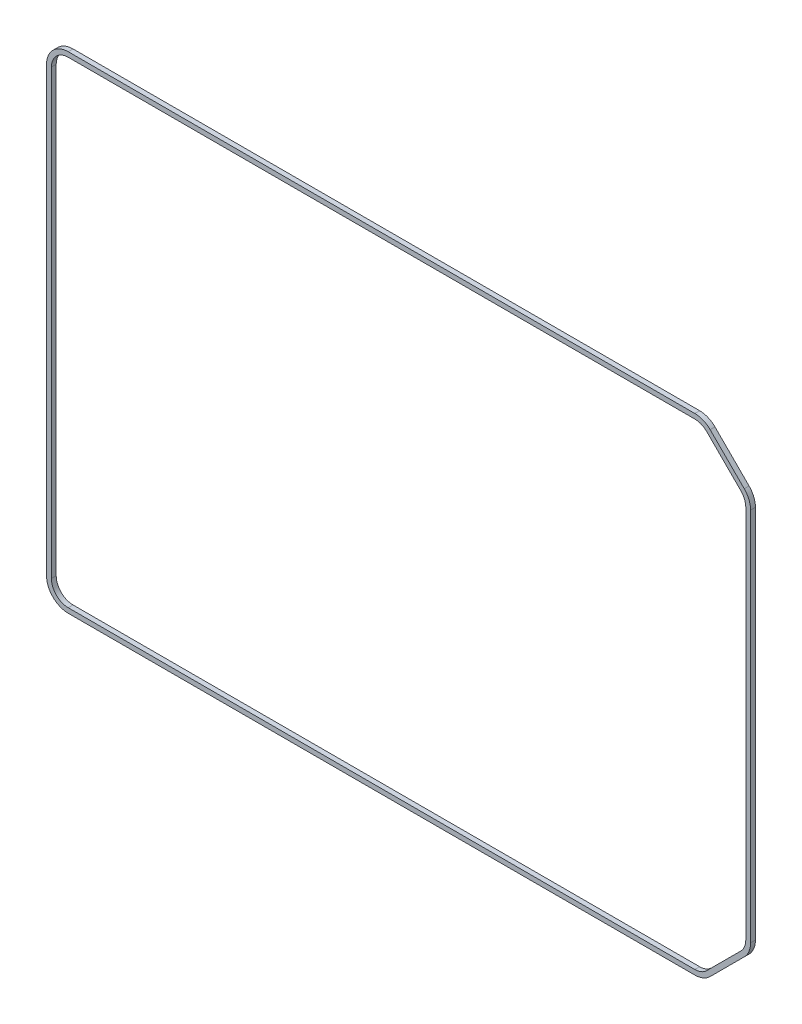
ISO-10303-21;
HEADER;
FILE_DESCRIPTION(('STEP AP214'),'2;1');
FILE_NAME('part.step','',(''),(''),'','','');
FILE_SCHEMA(('AUTOMOTIVE_DESIGN { 1 0 10303 214 1 1 1 1 }'));
ENDSEC;
DATA;
#1=APPLICATION_CONTEXT('core data for automotive mechanical design processes');
#2=APPLICATION_PROTOCOL_DEFINITION('international standard','automotive_design',2000,#1);
#3=PRODUCT_CONTEXT('',#1,'mechanical');
#4=PRODUCT('Part','Part','',(#3));
#5=PRODUCT_RELATED_PRODUCT_CATEGORY('part','',(#4));
#6=PRODUCT_DEFINITION_FORMATION('','',#4);
#7=PRODUCT_DEFINITION_CONTEXT('part definition',#1,'design');
#8=PRODUCT_DEFINITION('design','',#6,#7);
#9=PRODUCT_DEFINITION_SHAPE('','',#8);
#10=(LENGTH_UNIT() NAMED_UNIT(*) SI_UNIT(.MILLI.,.METRE.));
#11=(NAMED_UNIT(*) PLANE_ANGLE_UNIT() SI_UNIT($,.RADIAN.));
#12=(NAMED_UNIT(*) SI_UNIT($,.STERADIAN.) SOLID_ANGLE_UNIT());
#13=UNCERTAINTY_MEASURE_WITH_UNIT(LENGTH_MEASURE(1.E-05),#10,'distance_accuracy_value','');
#14=(GEOMETRIC_REPRESENTATION_CONTEXT(3) GLOBAL_UNCERTAINTY_ASSIGNED_CONTEXT((#13)) GLOBAL_UNIT_ASSIGNED_CONTEXT((#10,
#11,#12)) REPRESENTATION_CONTEXT('',''));
#15=CARTESIAN_POINT('',(0.,0.,0.));
#16=DIRECTION('',(0.,0.,1.));
#17=DIRECTION('',(1.,0.,0.));
#18=AXIS2_PLACEMENT_3D('',#15,#16,#17);
#19=CARTESIAN_POINT('',(-68.495,45.925,1.));
#20=DIRECTION('',(0.,0.,-1.));
#21=DIRECTION('',(-1.,0.,0.));
#22=AXIS2_PLACEMENT_3D('',#19,#20,#21);
#23=PLANE('',#22);
#24=CARTESIAN_POINT('',(-68.495,45.925,1.));
#25=DIRECTION('',(0.,0.,1.));
#26=DIRECTION('',(-1.,0.,0.));
#27=AXIS2_PLACEMENT_3D('',#24,#25,#26);
#28=CIRCLE('',#27,4.5);
#29=CARTESIAN_POINT('',(-68.495,50.425,1.));
#30=VERTEX_POINT('',#29);
#31=CARTESIAN_POINT('',(-72.995,45.925,1.));
#32=VERTEX_POINT('',#31);
#33=EDGE_CURVE('E293',#30,#32,#28,.T.);
#34=ORIENTED_EDGE('',*,*,#33,.T.);
#35=DIRECTION('',(0.,-1.,0.));
#36=VECTOR('',#35,1.);
#37=CARTESIAN_POINT('',(-72.995,-45.925,1.));
#38=LINE('',#37,#36);
#39=CARTESIAN_POINT('',(-72.995,-45.925,1.));
#40=VERTEX_POINT('',#39);
#41=EDGE_CURVE('E296',#32,#40,#38,.T.);
#42=ORIENTED_EDGE('',*,*,#41,.T.);
#43=CARTESIAN_POINT('',(-68.495,-45.925,1.));
#44=DIRECTION('',(0.,0.,1.));
#45=DIRECTION('',(-1.,0.,0.));
#46=AXIS2_PLACEMENT_3D('',#43,#44,#45);
#47=CIRCLE('',#46,4.5);
#48=CARTESIAN_POINT('',(-68.495,-50.425,1.));
#49=VERTEX_POINT('',#48);
#50=EDGE_CURVE('E299',#40,#49,#47,.T.);
#51=ORIENTED_EDGE('',*,*,#50,.T.);
#52=DIRECTION('',(1.,0.,0.));
#53=VECTOR('',#52,1.);
#54=CARTESIAN_POINT('',(-68.495,-50.425,1.));
#55=LINE('',#54,#53);
#56=CARTESIAN_POINT('',(61.4239321881345,-50.425,1.));
#57=VERTEX_POINT('',#56);
#58=EDGE_CURVE('E301',#49,#57,#55,.T.);
#59=ORIENTED_EDGE('',*,*,#58,.T.);
#60=CARTESIAN_POINT('',(61.4239321881345,-45.925,1.));
#61=DIRECTION('',(0.,0.,1.));
#62=DIRECTION('',(-1.,0.,0.));
#63=AXIS2_PLACEMENT_3D('',#60,#61,#62);
#64=CIRCLE('',#63,4.5);
#65=CARTESIAN_POINT('',(64.605912703474,-49.1069805153394,1.));
#66=VERTEX_POINT('',#65);
#67=EDGE_CURVE('E303',#57,#66,#64,.T.);
#68=ORIENTED_EDGE('',*,*,#67,.T.);
#69=DIRECTION('',(0.707106781186547,0.707106781186548,0.));
#70=VECTOR('',#69,1.);
#71=CARTESIAN_POINT('',(71.6769805153394,-42.035912703474,1.));
#72=LINE('',#71,#70);
#73=CARTESIAN_POINT('',(71.6769805153394,-42.035912703474,1.));
#74=VERTEX_POINT('',#73);
#75=EDGE_CURVE('E305',#66,#74,#72,.T.);
#76=ORIENTED_EDGE('',*,*,#75,.T.);
#77=CARTESIAN_POINT('',(68.495,-38.8539321881345,1.));
#78=DIRECTION('',(0.,0.,1.));
#79=DIRECTION('',(-1.,0.,0.));
#80=AXIS2_PLACEMENT_3D('',#77,#78,#79);
#81=CIRCLE('',#80,4.5);
#82=CARTESIAN_POINT('',(72.995,-38.8539321881345,1.));
#83=VERTEX_POINT('',#82);
#84=EDGE_CURVE('E307',#74,#83,#81,.T.);
#85=ORIENTED_EDGE('',*,*,#84,.T.);
#86=DIRECTION('',(0.,1.,0.));
#87=VECTOR('',#86,1.);
#88=CARTESIAN_POINT('',(72.995,38.8539321881345,1.));
#89=LINE('',#88,#87);
#90=CARTESIAN_POINT('',(72.995,38.8539321881345,1.));
#91=VERTEX_POINT('',#90);
#92=EDGE_CURVE('E309',#83,#91,#89,.T.);
#93=ORIENTED_EDGE('',*,*,#92,.T.);
#94=CARTESIAN_POINT('',(68.495,38.8539321881345,1.));
#95=DIRECTION('',(0.,0.,1.));
#96=DIRECTION('',(-1.,0.,0.));
#97=AXIS2_PLACEMENT_3D('',#94,#95,#96);
#98=CIRCLE('',#97,4.5);
#99=CARTESIAN_POINT('',(71.6769805153394,42.035912703474,1.));
#100=VERTEX_POINT('',#99);
#101=EDGE_CURVE('E311',#91,#100,#98,.T.);
#102=ORIENTED_EDGE('',*,*,#101,.T.);
#103=DIRECTION('',(-0.707106781186547,0.707106781186548,0.));
#104=VECTOR('',#103,1.);
#105=CARTESIAN_POINT('',(64.605912703474,49.1069805153395,1.));
#106=LINE('',#105,#104);
#107=CARTESIAN_POINT('',(64.605912703474,49.1069805153395,1.));
#108=VERTEX_POINT('',#107);
#109=EDGE_CURVE('E313',#100,#108,#106,.T.);
#110=ORIENTED_EDGE('',*,*,#109,.T.);
#111=CARTESIAN_POINT('',(61.4239321881345,45.925,1.));
#112=DIRECTION('',(0.,0.,1.));
#113=DIRECTION('',(-1.,0.,0.));
#114=AXIS2_PLACEMENT_3D('',#111,#112,#113);
#115=CIRCLE('',#114,4.5);
#116=CARTESIAN_POINT('',(61.4239321881345,50.425,1.));
#117=VERTEX_POINT('',#116);
#118=EDGE_CURVE('E315',#108,#117,#115,.T.);
#119=ORIENTED_EDGE('',*,*,#118,.T.);
#120=DIRECTION('',(-1.,0.,0.));
#121=VECTOR('',#120,1.);
#122=CARTESIAN_POINT('',(-68.495,50.425,1.));
#123=LINE('',#122,#121);
#124=EDGE_CURVE('E317',#117,#30,#123,.T.);
#125=ORIENTED_EDGE('',*,*,#124,.T.);
#126=EDGE_LOOP('',(#34,#42,#51,#59,#68,#76,#85,#93,#102,#110,#119,#125));
#127=FACE_BOUND('',#126,.T.);
#128=CARTESIAN_POINT('',(-68.495,45.925,1.));
#129=DIRECTION('',(0.,0.,1.));
#130=DIRECTION('',(-1.,0.,0.));
#131=AXIS2_PLACEMENT_3D('',#128,#129,#130);
#132=CIRCLE('',#131,3.5);
#133=CARTESIAN_POINT('',(-68.495,49.425,1.));
#134=VERTEX_POINT('',#133);
#135=CARTESIAN_POINT('',(-71.995,45.925,1.));
#136=VERTEX_POINT('',#135);
#137=EDGE_CURVE('E200',#134,#136,#132,.T.);
#138=ORIENTED_EDGE('',*,*,#137,.F.);
#139=DIRECTION('',(-1.,0.,0.));
#140=VECTOR('',#139,1.);
#141=CARTESIAN_POINT('',(61.4239321881345,49.425,1.));
#142=LINE('',#141,#140);
#143=CARTESIAN_POINT('',(61.4239321881345,49.425,1.));
#144=VERTEX_POINT('',#143);
#145=EDGE_CURVE('E241',#144,#134,#142,.T.);
#146=ORIENTED_EDGE('',*,*,#145,.F.);
#147=CARTESIAN_POINT('',(61.4239321881345,45.925,1.));
#148=DIRECTION('',(0.,0.,1.));
#149=DIRECTION('',(-1.,0.,0.));
#150=AXIS2_PLACEMENT_3D('',#147,#148,#149);
#151=CIRCLE('',#150,3.5);
#152=CARTESIAN_POINT('',(63.8988059222874,48.3998737341529,1.));
#153=VERTEX_POINT('',#152);
#154=EDGE_CURVE('E239',#153,#144,#151,.T.);
#155=ORIENTED_EDGE('',*,*,#154,.F.);
#156=DIRECTION('',(-0.707106781186547,0.707106781186548,0.));
#157=VECTOR('',#156,1.);
#158=CARTESIAN_POINT('',(63.8988059222874,48.3998737341529,1.));
#159=LINE('',#158,#157);
#160=CARTESIAN_POINT('',(70.9698737341529,41.3288059222875,1.));
#161=VERTEX_POINT('',#160);
#162=EDGE_CURVE('E237',#161,#153,#159,.T.);
#163=ORIENTED_EDGE('',*,*,#162,.F.);
#164=CARTESIAN_POINT('',(68.495,38.8539321881345,1.));
#165=DIRECTION('',(0.,0.,1.));
#166=DIRECTION('',(-1.,0.,0.));
#167=AXIS2_PLACEMENT_3D('',#164,#165,#166);
#168=CIRCLE('',#167,3.5);
#169=CARTESIAN_POINT('',(71.995,38.8539321881345,1.));
#170=VERTEX_POINT('',#169);
#171=EDGE_CURVE('E235',#170,#161,#168,.T.);
#172=ORIENTED_EDGE('',*,*,#171,.F.);
#173=DIRECTION('',(0.,1.,0.));
#174=VECTOR('',#173,1.);
#175=CARTESIAN_POINT('',(71.995,38.8539321881345,1.));
#176=LINE('',#175,#174);
#177=CARTESIAN_POINT('',(71.995,-38.8539321881345,1.));
#178=VERTEX_POINT('',#177);
#179=EDGE_CURVE('E233',#178,#170,#176,.T.);
#180=ORIENTED_EDGE('',*,*,#179,.F.);
#181=CARTESIAN_POINT('',(68.495,-38.8539321881345,1.));
#182=DIRECTION('',(0.,0.,1.));
#183=DIRECTION('',(-1.,0.,0.));
#184=AXIS2_PLACEMENT_3D('',#181,#182,#183);
#185=CIRCLE('',#184,3.5);
#186=CARTESIAN_POINT('',(70.9698737341529,-41.3288059222874,1.));
#187=VERTEX_POINT('',#186);
#188=EDGE_CURVE('E231',#187,#178,#185,.T.);
#189=ORIENTED_EDGE('',*,*,#188,.F.);
#190=DIRECTION('',(0.707106781186548,0.707106781186547,0.));
#191=VECTOR('',#190,1.);
#192=CARTESIAN_POINT('',(70.9698737341529,-41.3288059222874,1.));
#193=LINE('',#192,#191);
#194=CARTESIAN_POINT('',(63.8988059222874,-48.3998737341529,1.));
#195=VERTEX_POINT('',#194);
#196=EDGE_CURVE('E229',#195,#187,#193,.T.);
#197=ORIENTED_EDGE('',*,*,#196,.F.);
#198=CARTESIAN_POINT('',(61.4239321881345,-45.925,1.));
#199=DIRECTION('',(0.,0.,1.));
#200=DIRECTION('',(-1.,0.,0.));
#201=AXIS2_PLACEMENT_3D('',#198,#199,#200);
#202=CIRCLE('',#201,3.49999999999999);
#203=CARTESIAN_POINT('',(61.4239321881345,-49.425,1.));
#204=VERTEX_POINT('',#203);
#205=EDGE_CURVE('E227',#204,#195,#202,.T.);
#206=ORIENTED_EDGE('',*,*,#205,.F.);
#207=DIRECTION('',(1.,0.,0.));
#208=VECTOR('',#207,1.);
#209=CARTESIAN_POINT('',(61.4239321881345,-49.425,1.));
#210=LINE('',#209,#208);
#211=CARTESIAN_POINT('',(-68.495,-49.425,1.));
#212=VERTEX_POINT('',#211);
#213=EDGE_CURVE('E223',#212,#204,#210,.T.);
#214=ORIENTED_EDGE('',*,*,#213,.F.);
#215=CARTESIAN_POINT('',(-68.495,-45.925,1.));
#216=DIRECTION('',(0.,0.,1.));
#217=DIRECTION('',(-1.,0.,0.));
#218=AXIS2_PLACEMENT_3D('',#215,#216,#217);
#219=CIRCLE('',#218,3.5);
#220=CARTESIAN_POINT('',(-71.995,-45.925,1.));
#221=VERTEX_POINT('',#220);
#222=EDGE_CURVE('E221',#221,#212,#219,.T.);
#223=ORIENTED_EDGE('',*,*,#222,.F.);
#224=DIRECTION('',(0.,-1.,0.));
#225=VECTOR('',#224,1.);
#226=CARTESIAN_POINT('',(-71.995,45.925,1.));
#227=LINE('',#226,#225);
#228=EDGE_CURVE('E208',#136,#221,#227,.T.);
#229=ORIENTED_EDGE('',*,*,#228,.F.);
#230=EDGE_LOOP('',(#138,#146,#155,#163,#172,#180,#189,#197,#206,#214,#223,#229));
#231=FACE_BOUND('',#230,.T.);
#232=ADVANCED_FACE('F39',(#127,#231),#23,.F.);
#233=CARTESIAN_POINT('',(-68.495,45.925,0.));
#234=DIRECTION('',(0.,0.,-1.));
#235=DIRECTION('',(-1.,0.,0.));
#236=AXIS2_PLACEMENT_3D('',#233,#234,#235);
#237=PLANE('',#236);
#238=CARTESIAN_POINT('',(-68.495,45.925,0.));
#239=DIRECTION('',(0.,0.,1.));
#240=DIRECTION('',(-1.,0.,0.));
#241=AXIS2_PLACEMENT_3D('',#238,#239,#240);
#242=CIRCLE('',#241,4.5);
#243=CARTESIAN_POINT('',(-68.495,50.425,0.));
#244=VERTEX_POINT('',#243);
#245=CARTESIAN_POINT('',(-72.995,45.925,0.));
#246=VERTEX_POINT('',#245);
#247=EDGE_CURVE('E216',#244,#246,#242,.T.);
#248=ORIENTED_EDGE('',*,*,#247,.F.);
#249=DIRECTION('',(-1.,0.,0.));
#250=VECTOR('',#249,1.);
#251=CARTESIAN_POINT('',(-68.495,50.425,0.));
#252=LINE('',#251,#250);
#253=CARTESIAN_POINT('',(61.4239321881345,50.425,0.));
#254=VERTEX_POINT('',#253);
#255=EDGE_CURVE('E297',#254,#244,#252,.T.);
#256=ORIENTED_EDGE('',*,*,#255,.F.);
#257=CARTESIAN_POINT('',(61.4239321881345,45.925,0.));
#258=DIRECTION('',(0.,0.,1.));
#259=DIRECTION('',(-1.,0.,0.));
#260=AXIS2_PLACEMENT_3D('',#257,#258,#259);
#261=CIRCLE('',#260,4.5);
#262=CARTESIAN_POINT('',(64.605912703474,49.1069805153395,0.));
#263=VERTEX_POINT('',#262);
#264=EDGE_CURVE('E340',#263,#254,#261,.T.);
#265=ORIENTED_EDGE('',*,*,#264,.F.);
#266=DIRECTION('',(-0.707106781186547,0.707106781186548,0.));
#267=VECTOR('',#266,1.);
#268=CARTESIAN_POINT('',(64.605912703474,49.1069805153395,0.));
#269=LINE('',#268,#267);
#270=CARTESIAN_POINT('',(71.6769805153394,42.035912703474,0.));
#271=VERTEX_POINT('',#270);
#272=EDGE_CURVE('E338',#271,#263,#269,.T.);
#273=ORIENTED_EDGE('',*,*,#272,.F.);
#274=CARTESIAN_POINT('',(68.495,38.8539321881345,0.));
#275=DIRECTION('',(0.,0.,1.));
#276=DIRECTION('',(-1.,0.,0.));
#277=AXIS2_PLACEMENT_3D('',#274,#275,#276);
#278=CIRCLE('',#277,4.5);
#279=CARTESIAN_POINT('',(72.995,38.8539321881345,0.));
#280=VERTEX_POINT('',#279);
#281=EDGE_CURVE('E336',#280,#271,#278,.T.);
#282=ORIENTED_EDGE('',*,*,#281,.F.);
#283=DIRECTION('',(0.,1.,0.));
#284=VECTOR('',#283,1.);
#285=CARTESIAN_POINT('',(72.995,38.8539321881345,0.));
#286=LINE('',#285,#284);
#287=CARTESIAN_POINT('',(72.995,-38.8539321881345,0.));
#288=VERTEX_POINT('',#287);
#289=EDGE_CURVE('E334',#288,#280,#286,.T.);
#290=ORIENTED_EDGE('',*,*,#289,.F.);
#291=CARTESIAN_POINT('',(68.495,-38.8539321881345,0.));
#292=DIRECTION('',(0.,0.,1.));
#293=DIRECTION('',(-1.,0.,0.));
#294=AXIS2_PLACEMENT_3D('',#291,#292,#293);
#295=CIRCLE('',#294,4.5);
#296=CARTESIAN_POINT('',(71.6769805153394,-42.035912703474,0.));
#297=VERTEX_POINT('',#296);
#298=EDGE_CURVE('E332',#297,#288,#295,.T.);
#299=ORIENTED_EDGE('',*,*,#298,.F.);
#300=DIRECTION('',(0.707106781186547,0.707106781186548,0.));
#301=VECTOR('',#300,1.);
#302=CARTESIAN_POINT('',(71.6769805153394,-42.035912703474,0.));
#303=LINE('',#302,#301);
#304=CARTESIAN_POINT('',(64.605912703474,-49.1069805153394,0.));
#305=VERTEX_POINT('',#304);
#306=EDGE_CURVE('E330',#305,#297,#303,.T.);
#307=ORIENTED_EDGE('',*,*,#306,.F.);
#308=CARTESIAN_POINT('',(61.4239321881345,-45.925,0.));
#309=DIRECTION('',(0.,0.,1.));
#310=DIRECTION('',(-1.,0.,0.));
#311=AXIS2_PLACEMENT_3D('',#308,#309,#310);
#312=CIRCLE('',#311,4.5);
#313=CARTESIAN_POINT('',(61.4239321881345,-50.425,0.));
#314=VERTEX_POINT('',#313);
#315=EDGE_CURVE('E328',#314,#305,#312,.T.);
#316=ORIENTED_EDGE('',*,*,#315,.F.);
#317=DIRECTION('',(1.,0.,0.));
#318=VECTOR('',#317,1.);
#319=CARTESIAN_POINT('',(-68.495,-50.425,0.));
#320=LINE('',#319,#318);
#321=CARTESIAN_POINT('',(-68.495,-50.425,0.));
#322=VERTEX_POINT('',#321);
#323=EDGE_CURVE('E326',#322,#314,#320,.T.);
#324=ORIENTED_EDGE('',*,*,#323,.F.);
#325=CARTESIAN_POINT('',(-68.495,-45.925,0.));
#326=DIRECTION('',(0.,0.,1.));
#327=DIRECTION('',(-1.,0.,0.));
#328=AXIS2_PLACEMENT_3D('',#325,#326,#327);
#329=CIRCLE('',#328,4.5);
#330=CARTESIAN_POINT('',(-72.995,-45.925,0.));
#331=VERTEX_POINT('',#330);
#332=EDGE_CURVE('E324',#331,#322,#329,.T.);
#333=ORIENTED_EDGE('',*,*,#332,.F.);
#334=DIRECTION('',(0.,-1.,0.));
#335=VECTOR('',#334,1.);
#336=CARTESIAN_POINT('',(-72.995,-45.925,0.));
#337=LINE('',#336,#335);
#338=EDGE_CURVE('E322',#246,#331,#337,.T.);
#339=ORIENTED_EDGE('',*,*,#338,.F.);
#340=EDGE_LOOP('',(#248,#256,#265,#273,#282,#290,#299,#307,#316,#324,#333,#339));
#341=FACE_BOUND('',#340,.T.);
#342=DIRECTION('',(-1.,0.,0.));
#343=VECTOR('',#342,1.);
#344=CARTESIAN_POINT('',(61.4239321881345,49.425,0.));
#345=LINE('',#344,#343);
#346=CARTESIAN_POINT('',(61.4239321881345,49.425,0.));
#347=VERTEX_POINT('',#346);
#348=CARTESIAN_POINT('',(-68.495,49.425,0.));
#349=VERTEX_POINT('',#348);
#350=EDGE_CURVE('E209',#347,#349,#345,.T.);
#351=ORIENTED_EDGE('',*,*,#350,.T.);
#352=CARTESIAN_POINT('',(-68.495,45.925,0.));
#353=DIRECTION('',(0.,0.,1.));
#354=DIRECTION('',(-1.,0.,0.));
#355=AXIS2_PLACEMENT_3D('',#352,#353,#354);
#356=CIRCLE('',#355,3.5);
#357=CARTESIAN_POINT('',(-71.995,45.925,0.));
#358=VERTEX_POINT('',#357);
#359=EDGE_CURVE('E62',#349,#358,#356,.T.);
#360=ORIENTED_EDGE('',*,*,#359,.T.);
#361=DIRECTION('',(0.,-1.,0.));
#362=VECTOR('',#361,1.);
#363=CARTESIAN_POINT('',(-71.995,45.925,0.));
#364=LINE('',#363,#362);
#365=CARTESIAN_POINT('',(-71.995,-45.925,0.));
#366=VERTEX_POINT('',#365);
#367=EDGE_CURVE('E215',#358,#366,#364,.T.);
#368=ORIENTED_EDGE('',*,*,#367,.T.);
#369=CARTESIAN_POINT('',(-68.495,-45.925,0.));
#370=DIRECTION('',(0.,0.,1.));
#371=DIRECTION('',(-1.,0.,0.));
#372=AXIS2_PLACEMENT_3D('',#369,#370,#371);
#373=CIRCLE('',#372,3.5);
#374=CARTESIAN_POINT('',(-68.495,-49.425,0.));
#375=VERTEX_POINT('',#374);
#376=EDGE_CURVE('E245',#366,#375,#373,.T.);
#377=ORIENTED_EDGE('',*,*,#376,.T.);
#378=DIRECTION('',(1.,0.,0.));
#379=VECTOR('',#378,1.);
#380=CARTESIAN_POINT('',(61.4239321881345,-49.425,0.));
#381=LINE('',#380,#379);
#382=CARTESIAN_POINT('',(61.4239321881345,-49.425,0.));
#383=VERTEX_POINT('',#382);
#384=EDGE_CURVE('E248',#375,#383,#381,.T.);
#385=ORIENTED_EDGE('',*,*,#384,.T.);
#386=CARTESIAN_POINT('',(61.4239321881345,-45.925,0.));
#387=DIRECTION('',(0.,0.,1.));
#388=DIRECTION('',(-1.,0.,0.));
#389=AXIS2_PLACEMENT_3D('',#386,#387,#388);
#390=CIRCLE('',#389,3.49999999999999);
#391=CARTESIAN_POINT('',(63.8988059222874,-48.3998737341529,0.));
#392=VERTEX_POINT('',#391);
#393=EDGE_CURVE('E251',#383,#392,#390,.T.);
#394=ORIENTED_EDGE('',*,*,#393,.T.);
#395=DIRECTION('',(0.707106781186548,0.707106781186547,0.));
#396=VECTOR('',#395,1.);
#397=CARTESIAN_POINT('',(70.9698737341529,-41.3288059222874,0.));
#398=LINE('',#397,#396);
#399=CARTESIAN_POINT('',(70.9698737341529,-41.3288059222874,0.));
#400=VERTEX_POINT('',#399);
#401=EDGE_CURVE('E254',#392,#400,#398,.T.);
#402=ORIENTED_EDGE('',*,*,#401,.T.);
#403=CARTESIAN_POINT('',(68.495,-38.8539321881345,0.));
#404=DIRECTION('',(0.,0.,1.));
#405=DIRECTION('',(-1.,0.,0.));
#406=AXIS2_PLACEMENT_3D('',#403,#404,#405);
#407=CIRCLE('',#406,3.5);
#408=CARTESIAN_POINT('',(71.995,-38.8539321881345,0.));
#409=VERTEX_POINT('',#408);
#410=EDGE_CURVE('E257',#400,#409,#407,.T.);
#411=ORIENTED_EDGE('',*,*,#410,.T.);
#412=DIRECTION('',(0.,1.,0.));
#413=VECTOR('',#412,1.);
#414=CARTESIAN_POINT('',(71.995,38.8539321881345,0.));
#415=LINE('',#414,#413);
#416=CARTESIAN_POINT('',(71.995,38.8539321881345,0.));
#417=VERTEX_POINT('',#416);
#418=EDGE_CURVE('E260',#409,#417,#415,.T.);
#419=ORIENTED_EDGE('',*,*,#418,.T.);
#420=CARTESIAN_POINT('',(68.495,38.8539321881345,0.));
#421=DIRECTION('',(0.,0.,1.));
#422=DIRECTION('',(-1.,0.,0.));
#423=AXIS2_PLACEMENT_3D('',#420,#421,#422);
#424=CIRCLE('',#423,3.5);
#425=CARTESIAN_POINT('',(70.9698737341529,41.3288059222875,0.));
#426=VERTEX_POINT('',#425);
#427=EDGE_CURVE('E263',#417,#426,#424,.T.);
#428=ORIENTED_EDGE('',*,*,#427,.T.);
#429=DIRECTION('',(-0.707106781186547,0.707106781186548,0.));
#430=VECTOR('',#429,1.);
#431=CARTESIAN_POINT('',(63.8988059222874,48.3998737341529,0.));
#432=LINE('',#431,#430);
#433=CARTESIAN_POINT('',(63.8988059222874,48.3998737341529,0.));
#434=VERTEX_POINT('',#433);
#435=EDGE_CURVE('E266',#426,#434,#432,.T.);
#436=ORIENTED_EDGE('',*,*,#435,.T.);
#437=CARTESIAN_POINT('',(61.4239321881345,45.925,0.));
#438=DIRECTION('',(0.,0.,1.));
#439=DIRECTION('',(-1.,0.,0.));
#440=AXIS2_PLACEMENT_3D('',#437,#438,#439);
#441=CIRCLE('',#440,3.5);
#442=EDGE_CURVE('E269',#434,#347,#441,.T.);
#443=ORIENTED_EDGE('',*,*,#442,.T.);
#444=EDGE_LOOP('',(#351,#360,#368,#377,#385,#394,#402,#411,#419,#428,#436,#443));
#445=FACE_BOUND('',#444,.T.);
#446=ADVANCED_FACE('F382',(#341,#445),#237,.T.);
#447=CARTESIAN_POINT('',(-68.495,45.925,1.));
#448=DIRECTION('',(0.,0.,-1.));
#449=DIRECTION('',(-1.,0.,0.));
#450=AXIS2_PLACEMENT_3D('',#447,#448,#449);
#451=CYLINDRICAL_SURFACE('',#450,4.5);
#452=ORIENTED_EDGE('',*,*,#247,.T.);
#453=DIRECTION('',(0.,0.,-1.));
#454=VECTOR('',#453,1.);
#455=CARTESIAN_POINT('',(-72.995,45.925,1.));
#456=LINE('',#455,#454);
#457=EDGE_CURVE('E11',#32,#246,#456,.T.);
#458=ORIENTED_EDGE('',*,*,#457,.F.);
#459=ORIENTED_EDGE('',*,*,#33,.F.);
#460=DIRECTION('',(0.,0.,-1.));
#461=VECTOR('',#460,1.);
#462=CARTESIAN_POINT('',(-68.495,50.425,1.));
#463=LINE('',#462,#461);
#464=EDGE_CURVE('E319',#30,#244,#463,.T.);
#465=ORIENTED_EDGE('',*,*,#464,.T.);
#466=EDGE_LOOP('',(#452,#458,#459,#465));
#467=FACE_BOUND('',#466,.T.);
#468=ADVANCED_FACE('F41',(#467),#451,.T.);
#469=CARTESIAN_POINT('',(-72.995,-45.925,1.));
#470=DIRECTION('',(1.,0.,0.));
#471=DIRECTION('',(0.,0.,-1.));
#472=AXIS2_PLACEMENT_3D('',#469,#470,#471);
#473=PLANE('',#472);
#474=ORIENTED_EDGE('',*,*,#338,.T.);
#475=DIRECTION('',(0.,0.,-1.));
#476=VECTOR('',#475,1.);
#477=CARTESIAN_POINT('',(-72.995,-45.925,1.));
#478=LINE('',#477,#476);
#479=EDGE_CURVE('E47',#40,#331,#478,.T.);
#480=ORIENTED_EDGE('',*,*,#479,.F.);
#481=ORIENTED_EDGE('',*,*,#41,.F.);
#482=ORIENTED_EDGE('',*,*,#457,.T.);
#483=EDGE_LOOP('',(#474,#480,#481,#482));
#484=FACE_BOUND('',#483,.T.);
#485=ADVANCED_FACE('F399',(#484),#473,.F.);
#486=CARTESIAN_POINT('',(-68.495,-45.925,1.));
#487=DIRECTION('',(0.,0.,-1.));
#488=DIRECTION('',(-1.,0.,0.));
#489=AXIS2_PLACEMENT_3D('',#486,#487,#488);
#490=CYLINDRICAL_SURFACE('',#489,4.5);
#491=ORIENTED_EDGE('',*,*,#332,.T.);
#492=DIRECTION('',(0.,0.,-1.));
#493=VECTOR('',#492,1.);
#494=CARTESIAN_POINT('',(-68.495,-50.425,1.));
#495=LINE('',#494,#493);
#496=EDGE_CURVE('E369',#49,#322,#495,.T.);
#497=ORIENTED_EDGE('',*,*,#496,.F.);
#498=ORIENTED_EDGE('',*,*,#50,.F.);
#499=ORIENTED_EDGE('',*,*,#479,.T.);
#500=EDGE_LOOP('',(#491,#497,#498,#499));
#501=FACE_BOUND('',#500,.T.);
#502=ADVANCED_FACE('F376',(#501),#490,.T.);
#503=CARTESIAN_POINT('',(-68.495,-50.425,1.));
#504=DIRECTION('',(0.,1.,0.));
#505=DIRECTION('',(0.,0.,1.));
#506=AXIS2_PLACEMENT_3D('',#503,#504,#505);
#507=PLANE('',#506);
#508=ORIENTED_EDGE('',*,*,#323,.T.);
#509=DIRECTION('',(0.,0.,-1.));
#510=VECTOR('',#509,1.);
#511=CARTESIAN_POINT('',(61.4239321881345,-50.425,1.));
#512=LINE('',#511,#510);
#513=EDGE_CURVE('E366',#57,#314,#512,.T.);
#514=ORIENTED_EDGE('',*,*,#513,.F.);
#515=ORIENTED_EDGE('',*,*,#58,.F.);
#516=ORIENTED_EDGE('',*,*,#496,.T.);
#517=EDGE_LOOP('',(#508,#514,#515,#516));
#518=FACE_BOUND('',#517,.T.);
#519=ADVANCED_FACE('F388',(#518),#507,.F.);
#520=CARTESIAN_POINT('',(61.4239321881345,-45.925,1.));
#521=DIRECTION('',(0.,0.,-1.));
#522=DIRECTION('',(-1.,0.,0.));
#523=AXIS2_PLACEMENT_3D('',#520,#521,#522);
#524=CYLINDRICAL_SURFACE('',#523,4.5);
#525=ORIENTED_EDGE('',*,*,#315,.T.);
#526=DIRECTION('',(0.,0.,-1.));
#527=VECTOR('',#526,1.);
#528=CARTESIAN_POINT('',(64.605912703474,-49.1069805153394,1.));
#529=LINE('',#528,#527);
#530=EDGE_CURVE('E363',#66,#305,#529,.T.);
#531=ORIENTED_EDGE('',*,*,#530,.F.);
#532=ORIENTED_EDGE('',*,*,#67,.F.);
#533=ORIENTED_EDGE('',*,*,#513,.T.);
#534=EDGE_LOOP('',(#525,#531,#532,#533));
#535=FACE_BOUND('',#534,.T.);
#536=ADVANCED_FACE('F392',(#535),#524,.T.);
#537=CARTESIAN_POINT('',(71.6769805153394,-42.035912703474,1.));
#538=DIRECTION('',(-0.707106781186548,0.707106781186547,0.));
#539=DIRECTION('',(-0.707106781186547,-0.707106781186548,0.));
#540=AXIS2_PLACEMENT_3D('',#537,#538,#539);
#541=PLANE('',#540);
#542=ORIENTED_EDGE('',*,*,#306,.T.);
#543=DIRECTION('',(0.,0.,-1.));
#544=VECTOR('',#543,1.);
#545=CARTESIAN_POINT('',(71.6769805153394,-42.035912703474,1.));
#546=LINE('',#545,#544);
#547=EDGE_CURVE('E360',#74,#297,#546,.T.);
#548=ORIENTED_EDGE('',*,*,#547,.F.);
#549=ORIENTED_EDGE('',*,*,#75,.F.);
#550=ORIENTED_EDGE('',*,*,#530,.T.);
#551=EDGE_LOOP('',(#542,#548,#549,#550));
#552=FACE_BOUND('',#551,.T.);
#553=ADVANCED_FACE('F432',(#552),#541,.F.);
#554=CARTESIAN_POINT('',(68.495,-38.8539321881345,1.));
#555=DIRECTION('',(0.,0.,-1.));
#556=DIRECTION('',(-1.,0.,0.));
#557=AXIS2_PLACEMENT_3D('',#554,#555,#556);
#558=CYLINDRICAL_SURFACE('',#557,4.5);
#559=ORIENTED_EDGE('',*,*,#298,.T.);
#560=DIRECTION('',(0.,0.,-1.));
#561=VECTOR('',#560,1.);
#562=CARTESIAN_POINT('',(72.995,-38.8539321881345,1.));
#563=LINE('',#562,#561);
#564=EDGE_CURVE('E357',#83,#288,#563,.T.);
#565=ORIENTED_EDGE('',*,*,#564,.F.);
#566=ORIENTED_EDGE('',*,*,#84,.F.);
#567=ORIENTED_EDGE('',*,*,#547,.T.);
#568=EDGE_LOOP('',(#559,#565,#566,#567));
#569=FACE_BOUND('',#568,.T.);
#570=ADVANCED_FACE('F430',(#569),#558,.T.);
#571=CARTESIAN_POINT('',(72.995,38.8539321881345,1.));
#572=DIRECTION('',(-1.,0.,0.));
#573=DIRECTION('',(0.,0.,1.));
#574=AXIS2_PLACEMENT_3D('',#571,#572,#573);
#575=PLANE('',#574);
#576=ORIENTED_EDGE('',*,*,#289,.T.);
#577=DIRECTION('',(0.,0.,-1.));
#578=VECTOR('',#577,1.);
#579=CARTESIAN_POINT('',(72.995,38.8539321881345,1.));
#580=LINE('',#579,#578);
#581=EDGE_CURVE('E354',#91,#280,#580,.T.);
#582=ORIENTED_EDGE('',*,*,#581,.F.);
#583=ORIENTED_EDGE('',*,*,#92,.F.);
#584=ORIENTED_EDGE('',*,*,#564,.T.);
#585=EDGE_LOOP('',(#576,#582,#583,#584));
#586=FACE_BOUND('',#585,.T.);
#587=ADVANCED_FACE('F426',(#586),#575,.F.);
#588=CARTESIAN_POINT('',(68.495,38.8539321881345,1.));
#589=DIRECTION('',(0.,0.,-1.));
#590=DIRECTION('',(-1.,0.,0.));
#591=AXIS2_PLACEMENT_3D('',#588,#589,#590);
#592=CYLINDRICAL_SURFACE('',#591,4.5);
#593=ORIENTED_EDGE('',*,*,#281,.T.);
#594=DIRECTION('',(0.,0.,-1.));
#595=VECTOR('',#594,1.);
#596=CARTESIAN_POINT('',(71.6769805153394,42.035912703474,1.));
#597=LINE('',#596,#595);
#598=EDGE_CURVE('E351',#100,#271,#597,.T.);
#599=ORIENTED_EDGE('',*,*,#598,.F.);
#600=ORIENTED_EDGE('',*,*,#101,.F.);
#601=ORIENTED_EDGE('',*,*,#581,.T.);
#602=EDGE_LOOP('',(#593,#599,#600,#601));
#603=FACE_BOUND('',#602,.T.);
#604=ADVANCED_FACE('F421',(#603),#592,.T.);
#605=CARTESIAN_POINT('',(64.605912703474,49.1069805153395,1.));
#606=DIRECTION('',(-0.707106781186548,-0.707106781186547,0.));
#607=DIRECTION('',(0.707106781186547,-0.707106781186548,0.));
#608=AXIS2_PLACEMENT_3D('',#605,#606,#607);
#609=PLANE('',#608);
#610=ORIENTED_EDGE('',*,*,#272,.T.);
#611=DIRECTION('',(0.,0.,-1.));
#612=VECTOR('',#611,1.);
#613=CARTESIAN_POINT('',(64.605912703474,49.1069805153395,1.));
#614=LINE('',#613,#612);
#615=EDGE_CURVE('E348',#108,#263,#614,.T.);
#616=ORIENTED_EDGE('',*,*,#615,.F.);
#617=ORIENTED_EDGE('',*,*,#109,.F.);
#618=ORIENTED_EDGE('',*,*,#598,.T.);
#619=EDGE_LOOP('',(#610,#616,#617,#618));
#620=FACE_BOUND('',#619,.T.);
#621=ADVANCED_FACE('F415',(#620),#609,.F.);
#622=CARTESIAN_POINT('',(61.4239321881345,45.925,1.));
#623=DIRECTION('',(0.,0.,-1.));
#624=DIRECTION('',(-1.,0.,0.));
#625=AXIS2_PLACEMENT_3D('',#622,#623,#624);
#626=CYLINDRICAL_SURFACE('',#625,4.5);
#627=ORIENTED_EDGE('',*,*,#264,.T.);
#628=DIRECTION('',(0.,0.,-1.));
#629=VECTOR('',#628,1.);
#630=CARTESIAN_POINT('',(61.4239321881345,50.425,1.));
#631=LINE('',#630,#629);
#632=EDGE_CURVE('E345',#117,#254,#631,.T.);
#633=ORIENTED_EDGE('',*,*,#632,.F.);
#634=ORIENTED_EDGE('',*,*,#118,.F.);
#635=ORIENTED_EDGE('',*,*,#615,.T.);
#636=EDGE_LOOP('',(#627,#633,#634,#635));
#637=FACE_BOUND('',#636,.T.);
#638=ADVANCED_FACE('F411',(#637),#626,.T.);
#639=CARTESIAN_POINT('',(-68.495,50.425,1.));
#640=DIRECTION('',(0.,-1.,0.));
#641=DIRECTION('',(1.,0.,0.));
#642=AXIS2_PLACEMENT_3D('',#639,#640,#641);
#643=PLANE('',#642);
#644=ORIENTED_EDGE('',*,*,#255,.T.);
#645=ORIENTED_EDGE('',*,*,#464,.F.);
#646=ORIENTED_EDGE('',*,*,#124,.F.);
#647=ORIENTED_EDGE('',*,*,#632,.T.);
#648=EDGE_LOOP('',(#644,#645,#646,#647));
#649=FACE_BOUND('',#648,.T.);
#650=ADVANCED_FACE('F406',(#649),#643,.F.);
#651=CARTESIAN_POINT('',(-68.495,45.925,1.));
#652=DIRECTION('',(0.,0.,-1.));
#653=DIRECTION('',(-1.,0.,0.));
#654=AXIS2_PLACEMENT_3D('',#651,#652,#653);
#655=CYLINDRICAL_SURFACE('',#654,3.5);
#656=ORIENTED_EDGE('',*,*,#359,.F.);
#657=DIRECTION('',(0.,0.,-1.));
#658=VECTOR('',#657,1.);
#659=CARTESIAN_POINT('',(-68.495,49.425,1.));
#660=LINE('',#659,#658);
#661=EDGE_CURVE('E204',#134,#349,#660,.T.);
#662=ORIENTED_EDGE('',*,*,#661,.F.);
#663=ORIENTED_EDGE('',*,*,#137,.T.);
#664=DIRECTION('',(0.,0.,-1.));
#665=VECTOR('',#664,1.);
#666=CARTESIAN_POINT('',(-71.995,45.925,1.));
#667=LINE('',#666,#665);
#668=EDGE_CURVE('E203',#136,#358,#667,.T.);
#669=ORIENTED_EDGE('',*,*,#668,.T.);
#670=EDGE_LOOP('',(#656,#662,#663,#669));
#671=FACE_BOUND('',#670,.T.);
#672=ADVANCED_FACE('F202',(#671),#655,.F.);
#673=CARTESIAN_POINT('',(-71.995,45.925,1.));
#674=DIRECTION('',(1.,0.,0.));
#675=DIRECTION('',(0.,0.,-1.));
#676=AXIS2_PLACEMENT_3D('',#673,#674,#675);
#677=PLANE('',#676);
#678=ORIENTED_EDGE('',*,*,#367,.F.);
#679=ORIENTED_EDGE('',*,*,#668,.F.);
#680=ORIENTED_EDGE('',*,*,#228,.T.);
#681=DIRECTION('',(0.,0.,-1.));
#682=VECTOR('',#681,1.);
#683=CARTESIAN_POINT('',(-71.995,-45.925,1.));
#684=LINE('',#683,#682);
#685=EDGE_CURVE('E217',#221,#366,#684,.T.);
#686=ORIENTED_EDGE('',*,*,#685,.T.);
#687=EDGE_LOOP('',(#678,#679,#680,#686));
#688=FACE_BOUND('',#687,.T.);
#689=ADVANCED_FACE('F212',(#688),#677,.T.);
#690=CARTESIAN_POINT('',(-68.495,-45.925,1.));
#691=DIRECTION('',(0.,0.,-1.));
#692=DIRECTION('',(-1.,0.,0.));
#693=AXIS2_PLACEMENT_3D('',#690,#691,#692);
#694=CYLINDRICAL_SURFACE('',#693,3.5);
#695=ORIENTED_EDGE('',*,*,#376,.F.);
#696=ORIENTED_EDGE('',*,*,#685,.F.);
#697=ORIENTED_EDGE('',*,*,#222,.T.);
#698=DIRECTION('',(0.,0.,-1.));
#699=VECTOR('',#698,1.);
#700=CARTESIAN_POINT('',(-68.495,-49.425,1.));
#701=LINE('',#700,#699);
#702=EDGE_CURVE('E290',#212,#375,#701,.T.);
#703=ORIENTED_EDGE('',*,*,#702,.T.);
#704=EDGE_LOOP('',(#695,#696,#697,#703));
#705=FACE_BOUND('',#704,.T.);
#706=ADVANCED_FACE('F490',(#705),#694,.F.);
#707=CARTESIAN_POINT('',(61.4239321881345,-49.425,1.));
#708=DIRECTION('',(0.,1.,0.));
#709=DIRECTION('',(-1.,0.,0.));
#710=AXIS2_PLACEMENT_3D('',#707,#708,#709);
#711=PLANE('',#710);
#712=ORIENTED_EDGE('',*,*,#384,.F.);
#713=ORIENTED_EDGE('',*,*,#702,.F.);
#714=ORIENTED_EDGE('',*,*,#213,.T.);
#715=DIRECTION('',(0.,0.,-1.));
#716=VECTOR('',#715,1.);
#717=CARTESIAN_POINT('',(61.4239321881345,-49.425,1.));
#718=LINE('',#717,#716);
#719=EDGE_CURVE('E288',#204,#383,#718,.T.);
#720=ORIENTED_EDGE('',*,*,#719,.T.);
#721=EDGE_LOOP('',(#712,#713,#714,#720));
#722=FACE_BOUND('',#721,.T.);
#723=ADVANCED_FACE('F496',(#722),#711,.T.);
#724=CARTESIAN_POINT('',(61.4239321881345,-45.925,1.));
#725=DIRECTION('',(0.,0.,-1.));
#726=DIRECTION('',(-1.,0.,0.));
#727=AXIS2_PLACEMENT_3D('',#724,#725,#726);
#728=CYLINDRICAL_SURFACE('',#727,3.49999999999999);
#729=ORIENTED_EDGE('',*,*,#393,.F.);
#730=ORIENTED_EDGE('',*,*,#719,.F.);
#731=ORIENTED_EDGE('',*,*,#205,.T.);
#732=DIRECTION('',(0.,0.,-1.));
#733=VECTOR('',#732,1.);
#734=CARTESIAN_POINT('',(63.8988059222874,-48.3998737341529,1.));
#735=LINE('',#734,#733);
#736=EDGE_CURVE('E286',#195,#392,#735,.T.);
#737=ORIENTED_EDGE('',*,*,#736,.T.);
#738=EDGE_LOOP('',(#729,#730,#731,#737));
#739=FACE_BOUND('',#738,.T.);
#740=ADVANCED_FACE('F504',(#739),#728,.F.);
#741=CARTESIAN_POINT('',(70.9698737341529,-41.3288059222874,1.));
#742=DIRECTION('',(-0.707106781186547,0.707106781186548,0.));
#743=DIRECTION('',(-0.707106781186548,-0.707106781186547,0.));
#744=AXIS2_PLACEMENT_3D('',#741,#742,#743);
#745=PLANE('',#744);
#746=ORIENTED_EDGE('',*,*,#401,.F.);
#747=ORIENTED_EDGE('',*,*,#736,.F.);
#748=ORIENTED_EDGE('',*,*,#196,.T.);
#749=DIRECTION('',(0.,0.,-1.));
#750=VECTOR('',#749,1.);
#751=CARTESIAN_POINT('',(70.9698737341529,-41.3288059222874,1.));
#752=LINE('',#751,#750);
#753=EDGE_CURVE('E284',#187,#400,#752,.T.);
#754=ORIENTED_EDGE('',*,*,#753,.T.);
#755=EDGE_LOOP('',(#746,#747,#748,#754));
#756=FACE_BOUND('',#755,.T.);
#757=ADVANCED_FACE('F512',(#756),#745,.T.);
#758=CARTESIAN_POINT('',(68.495,-38.8539321881345,1.));
#759=DIRECTION('',(0.,0.,-1.));
#760=DIRECTION('',(-1.,0.,0.));
#761=AXIS2_PLACEMENT_3D('',#758,#759,#760);
#762=CYLINDRICAL_SURFACE('',#761,3.5);
#763=ORIENTED_EDGE('',*,*,#410,.F.);
#764=ORIENTED_EDGE('',*,*,#753,.F.);
#765=ORIENTED_EDGE('',*,*,#188,.T.);
#766=DIRECTION('',(0.,0.,-1.));
#767=VECTOR('',#766,1.);
#768=CARTESIAN_POINT('',(71.995,-38.8539321881345,1.));
#769=LINE('',#768,#767);
#770=EDGE_CURVE('E282',#178,#409,#769,.T.);
#771=ORIENTED_EDGE('',*,*,#770,.T.);
#772=EDGE_LOOP('',(#763,#764,#765,#771));
#773=FACE_BOUND('',#772,.T.);
#774=ADVANCED_FACE('F520',(#773),#762,.F.);
#775=CARTESIAN_POINT('',(71.995,38.8539321881345,1.));
#776=DIRECTION('',(-1.,0.,0.));
#777=DIRECTION('',(0.,0.,1.));
#778=AXIS2_PLACEMENT_3D('',#775,#776,#777);
#779=PLANE('',#778);
#780=ORIENTED_EDGE('',*,*,#418,.F.);
#781=ORIENTED_EDGE('',*,*,#770,.F.);
#782=ORIENTED_EDGE('',*,*,#179,.T.);
#783=DIRECTION('',(0.,0.,-1.));
#784=VECTOR('',#783,1.);
#785=CARTESIAN_POINT('',(71.995,38.8539321881345,1.));
#786=LINE('',#785,#784);
#787=EDGE_CURVE('E280',#170,#417,#786,.T.);
#788=ORIENTED_EDGE('',*,*,#787,.T.);
#789=EDGE_LOOP('',(#780,#781,#782,#788));
#790=FACE_BOUND('',#789,.T.);
#791=ADVANCED_FACE('F528',(#790),#779,.T.);
#792=CARTESIAN_POINT('',(68.495,38.8539321881345,1.));
#793=DIRECTION('',(0.,0.,-1.));
#794=DIRECTION('',(-1.,0.,0.));
#795=AXIS2_PLACEMENT_3D('',#792,#793,#794);
#796=CYLINDRICAL_SURFACE('',#795,3.5);
#797=ORIENTED_EDGE('',*,*,#427,.F.);
#798=ORIENTED_EDGE('',*,*,#787,.F.);
#799=ORIENTED_EDGE('',*,*,#171,.T.);
#800=DIRECTION('',(0.,0.,-1.));
#801=VECTOR('',#800,1.);
#802=CARTESIAN_POINT('',(70.9698737341529,41.3288059222875,1.));
#803=LINE('',#802,#801);
#804=EDGE_CURVE('E278',#161,#426,#803,.T.);
#805=ORIENTED_EDGE('',*,*,#804,.T.);
#806=EDGE_LOOP('',(#797,#798,#799,#805));
#807=FACE_BOUND('',#806,.T.);
#808=ADVANCED_FACE('F536',(#807),#796,.F.);
#809=CARTESIAN_POINT('',(63.8988059222874,48.3998737341529,1.));
#810=DIRECTION('',(-0.707106781186548,-0.707106781186547,0.));
#811=DIRECTION('',(0.707106781186547,-0.707106781186548,0.));
#812=AXIS2_PLACEMENT_3D('',#809,#810,#811);
#813=PLANE('',#812);
#814=ORIENTED_EDGE('',*,*,#435,.F.);
#815=ORIENTED_EDGE('',*,*,#804,.F.);
#816=ORIENTED_EDGE('',*,*,#162,.T.);
#817=DIRECTION('',(0.,0.,-1.));
#818=VECTOR('',#817,1.);
#819=CARTESIAN_POINT('',(63.8988059222874,48.3998737341529,1.));
#820=LINE('',#819,#818);
#821=EDGE_CURVE('E276',#153,#434,#820,.T.);
#822=ORIENTED_EDGE('',*,*,#821,.T.);
#823=EDGE_LOOP('',(#814,#815,#816,#822));
#824=FACE_BOUND('',#823,.T.);
#825=ADVANCED_FACE('F544',(#824),#813,.T.);
#826=CARTESIAN_POINT('',(61.4239321881345,45.925,1.));
#827=DIRECTION('',(0.,0.,-1.));
#828=DIRECTION('',(-1.,0.,0.));
#829=AXIS2_PLACEMENT_3D('',#826,#827,#828);
#830=CYLINDRICAL_SURFACE('',#829,3.5);
#831=ORIENTED_EDGE('',*,*,#442,.F.);
#832=ORIENTED_EDGE('',*,*,#821,.F.);
#833=ORIENTED_EDGE('',*,*,#154,.T.);
#834=DIRECTION('',(0.,0.,-1.));
#835=VECTOR('',#834,1.);
#836=CARTESIAN_POINT('',(61.4239321881345,49.425,1.));
#837=LINE('',#836,#835);
#838=EDGE_CURVE('E54',#144,#347,#837,.T.);
#839=ORIENTED_EDGE('',*,*,#838,.T.);
#840=EDGE_LOOP('',(#831,#832,#833,#839));
#841=FACE_BOUND('',#840,.T.);
#842=ADVANCED_FACE('F552',(#841),#830,.F.);
#843=CARTESIAN_POINT('',(61.4239321881345,49.425,1.));
#844=DIRECTION('',(0.,-1.,0.));
#845=DIRECTION('',(1.,0.,0.));
#846=AXIS2_PLACEMENT_3D('',#843,#844,#845);
#847=PLANE('',#846);
#848=ORIENTED_EDGE('',*,*,#350,.F.);
#849=ORIENTED_EDGE('',*,*,#838,.F.);
#850=ORIENTED_EDGE('',*,*,#145,.T.);
#851=ORIENTED_EDGE('',*,*,#661,.T.);
#852=EDGE_LOOP('',(#848,#849,#850,#851));
#853=FACE_BOUND('',#852,.T.);
#854=ADVANCED_FACE('F560',(#853),#847,.T.);
#855=CLOSED_SHELL('',(#232,#446,#468,#485,#502,#519,#536,#553,#570,#587,#604,#621,#638,#650,
#672,#689,#706,#723,#740,#757,#774,#791,#808,#825,#842,#854));
#856=MANIFOLD_SOLID_BREP('B2',#855);
#857=ADVANCED_BREP_SHAPE_REPRESENTATION('',(#18,#856),#14);
#858=SHAPE_DEFINITION_REPRESENTATION(#9,#857);
ENDSEC;
END-ISO-10303-21;
